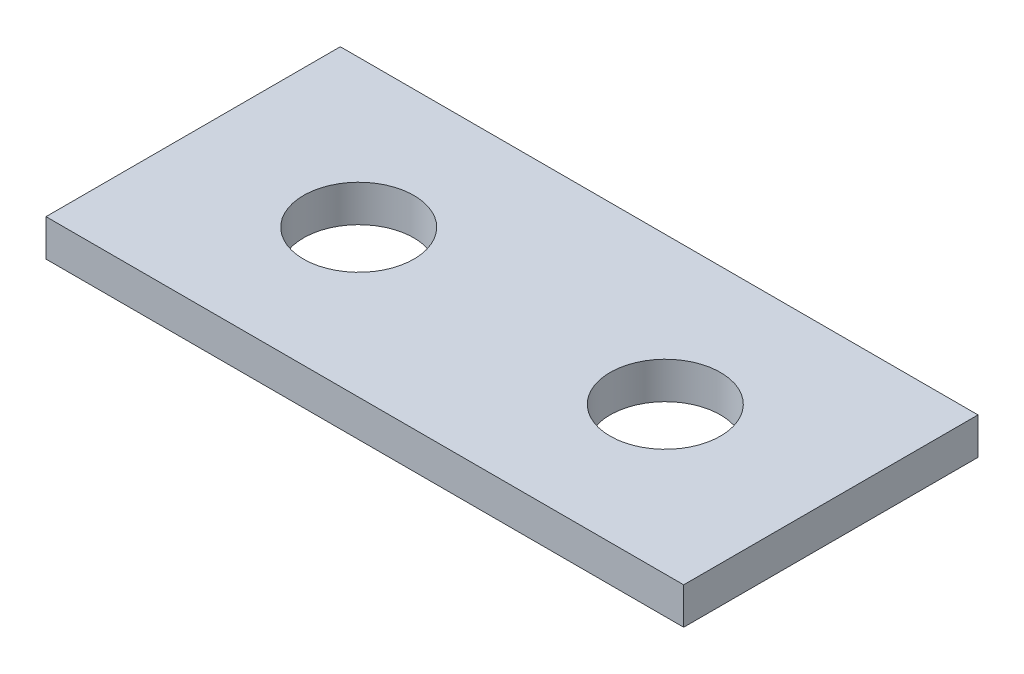
ISO-10303-21;
HEADER;
FILE_DESCRIPTION(('STEP AP214'),'2;1');
FILE_NAME('part.step','',(''),(''),'','','');
FILE_SCHEMA(('AUTOMOTIVE_DESIGN { 1 0 10303 214 1 1 1 1 }'));
ENDSEC;
DATA;
#1=APPLICATION_CONTEXT('core data for automotive mechanical design processes');
#2=APPLICATION_PROTOCOL_DEFINITION('international standard','automotive_design',2000,#1);
#3=PRODUCT_CONTEXT('',#1,'mechanical');
#4=PRODUCT('Part','Part','',(#3));
#5=PRODUCT_RELATED_PRODUCT_CATEGORY('part','',(#4));
#6=PRODUCT_DEFINITION_FORMATION('','',#4);
#7=PRODUCT_DEFINITION_CONTEXT('part definition',#1,'design');
#8=PRODUCT_DEFINITION('design','',#6,#7);
#9=PRODUCT_DEFINITION_SHAPE('','',#8);
#10=(LENGTH_UNIT() NAMED_UNIT(*) SI_UNIT(.MILLI.,.METRE.));
#11=(NAMED_UNIT(*) PLANE_ANGLE_UNIT() SI_UNIT($,.RADIAN.));
#12=(NAMED_UNIT(*) SI_UNIT($,.STERADIAN.) SOLID_ANGLE_UNIT());
#13=UNCERTAINTY_MEASURE_WITH_UNIT(LENGTH_MEASURE(1.E-05),#10,'distance_accuracy_value','');
#14=(GEOMETRIC_REPRESENTATION_CONTEXT(3) GLOBAL_UNCERTAINTY_ASSIGNED_CONTEXT((#13)) GLOBAL_UNIT_ASSIGNED_CONTEXT((#10,
#11,#12)) REPRESENTATION_CONTEXT('',''));
#15=CARTESIAN_POINT('',(0.,0.,0.));
#16=DIRECTION('',(0.,0.,1.));
#17=DIRECTION('',(1.,0.,0.));
#18=AXIS2_PLACEMENT_3D('',#15,#16,#17);
#19=CARTESIAN_POINT('',(13.,1.5,5.99999999999999));
#20=DIRECTION('',(0.,1.,0.));
#21=DIRECTION('',(0.,0.,1.));
#22=AXIS2_PLACEMENT_3D('',#19,#20,#21);
#23=PLANE('',#22);
#24=DIRECTION('',(0.,0.,-1.));
#25=VECTOR('',#24,1.);
#26=CARTESIAN_POINT('',(13.,1.5,-6.00000000000001));
#27=LINE('',#26,#25);
#28=CARTESIAN_POINT('',(13.,1.5,5.99999999999999));
#29=VERTEX_POINT('',#28);
#30=CARTESIAN_POINT('',(13.,1.5,-6.00000000000001));
#31=VERTEX_POINT('',#30);
#32=EDGE_CURVE('E84',#29,#31,#27,.T.);
#33=ORIENTED_EDGE('',*,*,#32,.T.);
#34=DIRECTION('',(-1.,0.,0.));
#35=VECTOR('',#34,1.);
#36=CARTESIAN_POINT('',(-13.,1.5,-6.00000000000001));
#37=LINE('',#36,#35);
#38=CARTESIAN_POINT('',(-13.,1.5,-6.00000000000001));
#39=VERTEX_POINT('',#38);
#40=EDGE_CURVE('E79',#31,#39,#37,.T.);
#41=ORIENTED_EDGE('',*,*,#40,.T.);
#42=DIRECTION('',(0.,0.,1.));
#43=VECTOR('',#42,1.);
#44=CARTESIAN_POINT('',(-13.,1.5,-6.00000000000001));
#45=LINE('',#44,#43);
#46=CARTESIAN_POINT('',(-13.,1.5,5.99999999999999));
#47=VERTEX_POINT('',#46);
#48=EDGE_CURVE('E82',#39,#47,#45,.T.);
#49=ORIENTED_EDGE('',*,*,#48,.T.);
#50=DIRECTION('',(1.,0.,0.));
#51=VECTOR('',#50,1.);
#52=CARTESIAN_POINT('',(-13.,1.5,5.99999999999999));
#53=LINE('',#52,#51);
#54=EDGE_CURVE('E49',#47,#29,#53,.T.);
#55=ORIENTED_EDGE('',*,*,#54,.T.);
#56=EDGE_LOOP('',(#33,#41,#49,#55));
#57=FACE_BOUND('',#56,.T.);
#58=CARTESIAN_POINT('',(-6.25,1.5,0.));
#59=DIRECTION('',(0.,1.,0.));
#60=DIRECTION('',(0.,0.,1.));
#61=AXIS2_PLACEMENT_3D('',#58,#59,#60);
#62=CIRCLE('',#61,2.25);
#63=CARTESIAN_POINT('',(-6.25,1.5,2.25));
#64=VERTEX_POINT('',#63);
#65=EDGE_CURVE('E111',#64,#64,#62,.T.);
#66=ORIENTED_EDGE('',*,*,#65,.F.);
#67=EDGE_LOOP('',(#66));
#68=FACE_BOUND('',#67,.T.);
#69=CARTESIAN_POINT('',(6.25,1.5,0.));
#70=DIRECTION('',(0.,-1.,0.));
#71=DIRECTION('',(0.,0.,1.));
#72=AXIS2_PLACEMENT_3D('',#69,#70,#71);
#73=CIRCLE('',#72,2.25);
#74=CARTESIAN_POINT('',(6.25,1.5,2.25));
#75=VERTEX_POINT('',#74);
#76=EDGE_CURVE('E117',#75,#75,#73,.T.);
#77=ORIENTED_EDGE('',*,*,#76,.T.);
#78=EDGE_LOOP('',(#77));
#79=FACE_BOUND('',#78,.T.);
#80=ADVANCED_FACE('F32',(#57,#68,#79),#23,.T.);
#81=CARTESIAN_POINT('',(13.,0.,5.99999999999999));
#82=DIRECTION('',(0.,1.,0.));
#83=DIRECTION('',(0.,0.,1.));
#84=AXIS2_PLACEMENT_3D('',#81,#82,#83);
#85=PLANE('',#84);
#86=DIRECTION('',(0.,0.,-1.));
#87=VECTOR('',#86,1.);
#88=CARTESIAN_POINT('',(13.,0.,-6.00000000000001));
#89=LINE('',#88,#87);
#90=CARTESIAN_POINT('',(13.,0.,5.99999999999999));
#91=VERTEX_POINT('',#90);
#92=CARTESIAN_POINT('',(13.,0.,-6.00000000000001));
#93=VERTEX_POINT('',#92);
#94=EDGE_CURVE('E96',#91,#93,#89,.T.);
#95=ORIENTED_EDGE('',*,*,#94,.F.);
#96=DIRECTION('',(1.,0.,0.));
#97=VECTOR('',#96,1.);
#98=CARTESIAN_POINT('',(-13.,0.,5.99999999999999));
#99=LINE('',#98,#97);
#100=CARTESIAN_POINT('',(-13.,0.,5.99999999999999));
#101=VERTEX_POINT('',#100);
#102=EDGE_CURVE('E72',#101,#91,#99,.T.);
#103=ORIENTED_EDGE('',*,*,#102,.F.);
#104=DIRECTION('',(0.,0.,1.));
#105=VECTOR('',#104,1.);
#106=CARTESIAN_POINT('',(-13.,0.,-6.00000000000001));
#107=LINE('',#106,#105);
#108=CARTESIAN_POINT('',(-13.,0.,-6.00000000000001));
#109=VERTEX_POINT('',#108);
#110=EDGE_CURVE('E66',#109,#101,#107,.T.);
#111=ORIENTED_EDGE('',*,*,#110,.F.);
#112=DIRECTION('',(-1.,0.,0.));
#113=VECTOR('',#112,1.);
#114=CARTESIAN_POINT('',(-13.,0.,-6.00000000000001));
#115=LINE('',#114,#113);
#116=EDGE_CURVE('E88',#93,#109,#115,.T.);
#117=ORIENTED_EDGE('',*,*,#116,.F.);
#118=EDGE_LOOP('',(#95,#103,#111,#117));
#119=FACE_BOUND('',#118,.T.);
#120=CARTESIAN_POINT('',(-6.25,0.,0.));
#121=DIRECTION('',(0.,1.,0.));
#122=DIRECTION('',(0.,0.,1.));
#123=AXIS2_PLACEMENT_3D('',#120,#121,#122);
#124=CIRCLE('',#123,2.25);
#125=CARTESIAN_POINT('',(-6.25,0.,2.25));
#126=VERTEX_POINT('',#125);
#127=EDGE_CURVE('E99',#126,#126,#124,.T.);
#128=ORIENTED_EDGE('',*,*,#127,.T.);
#129=EDGE_LOOP('',(#128));
#130=FACE_BOUND('',#129,.T.);
#131=CARTESIAN_POINT('',(6.25,0.,0.));
#132=DIRECTION('',(0.,-1.,0.));
#133=DIRECTION('',(0.,0.,1.));
#134=AXIS2_PLACEMENT_3D('',#131,#132,#133);
#135=CIRCLE('',#134,2.25);
#136=CARTESIAN_POINT('',(6.25,0.,2.25));
#137=VERTEX_POINT('',#136);
#138=EDGE_CURVE('E114',#137,#137,#135,.T.);
#139=ORIENTED_EDGE('',*,*,#138,.F.);
#140=EDGE_LOOP('',(#139));
#141=FACE_BOUND('',#140,.T.);
#142=ADVANCED_FACE('F107',(#119,#130,#141),#85,.F.);
#143=CARTESIAN_POINT('',(13.,1.5,-6.00000000000001));
#144=DIRECTION('',(-1.,0.,0.));
#145=DIRECTION('',(0.,0.,1.));
#146=AXIS2_PLACEMENT_3D('',#143,#144,#145);
#147=PLANE('',#146);
#148=ORIENTED_EDGE('',*,*,#94,.T.);
#149=DIRECTION('',(0.,-1.,0.));
#150=VECTOR('',#149,1.);
#151=CARTESIAN_POINT('',(13.,1.5,-6.00000000000001));
#152=LINE('',#151,#150);
#153=EDGE_CURVE('E11',#31,#93,#152,.T.);
#154=ORIENTED_EDGE('',*,*,#153,.F.);
#155=ORIENTED_EDGE('',*,*,#32,.F.);
#156=DIRECTION('',(0.,-1.,0.));
#157=VECTOR('',#156,1.);
#158=CARTESIAN_POINT('',(13.,1.5,5.99999999999999));
#159=LINE('',#158,#157);
#160=EDGE_CURVE('E92',#29,#91,#159,.T.);
#161=ORIENTED_EDGE('',*,*,#160,.T.);
#162=EDGE_LOOP('',(#148,#154,#155,#161));
#163=FACE_BOUND('',#162,.T.);
#164=ADVANCED_FACE('F34',(#163),#147,.F.);
#165=CARTESIAN_POINT('',(-13.,1.5,-6.00000000000001));
#166=DIRECTION('',(0.,0.,1.));
#167=DIRECTION('',(1.,0.,0.));
#168=AXIS2_PLACEMENT_3D('',#165,#166,#167);
#169=PLANE('',#168);
#170=ORIENTED_EDGE('',*,*,#116,.T.);
#171=DIRECTION('',(0.,-1.,0.));
#172=VECTOR('',#171,1.);
#173=CARTESIAN_POINT('',(-13.,1.5,-6.00000000000001));
#174=LINE('',#173,#172);
#175=EDGE_CURVE('E41',#39,#109,#174,.T.);
#176=ORIENTED_EDGE('',*,*,#175,.F.);
#177=ORIENTED_EDGE('',*,*,#40,.F.);
#178=ORIENTED_EDGE('',*,*,#153,.T.);
#179=EDGE_LOOP('',(#170,#176,#177,#178));
#180=FACE_BOUND('',#179,.T.);
#181=ADVANCED_FACE('F87',(#180),#169,.F.);
#182=CARTESIAN_POINT('',(-13.,1.5,-6.00000000000001));
#183=DIRECTION('',(1.,0.,0.));
#184=DIRECTION('',(0.,0.,-1.));
#185=AXIS2_PLACEMENT_3D('',#182,#183,#184);
#186=PLANE('',#185);
#187=ORIENTED_EDGE('',*,*,#110,.T.);
#188=DIRECTION('',(0.,-1.,0.));
#189=VECTOR('',#188,1.);
#190=CARTESIAN_POINT('',(-13.,1.5,5.99999999999999));
#191=LINE('',#190,#189);
#192=EDGE_CURVE('E89',#47,#101,#191,.T.);
#193=ORIENTED_EDGE('',*,*,#192,.F.);
#194=ORIENTED_EDGE('',*,*,#48,.F.);
#195=ORIENTED_EDGE('',*,*,#175,.T.);
#196=EDGE_LOOP('',(#187,#193,#194,#195));
#197=FACE_BOUND('',#196,.T.);
#198=ADVANCED_FACE('F90',(#197),#186,.F.);
#199=CARTESIAN_POINT('',(-13.,1.5,5.99999999999999));
#200=DIRECTION('',(0.,0.,-1.));
#201=DIRECTION('',(-1.,0.,0.));
#202=AXIS2_PLACEMENT_3D('',#199,#200,#201);
#203=PLANE('',#202);
#204=ORIENTED_EDGE('',*,*,#102,.T.);
#205=ORIENTED_EDGE('',*,*,#160,.F.);
#206=ORIENTED_EDGE('',*,*,#54,.F.);
#207=ORIENTED_EDGE('',*,*,#192,.T.);
#208=EDGE_LOOP('',(#204,#205,#206,#207));
#209=FACE_BOUND('',#208,.T.);
#210=ADVANCED_FACE('F104',(#209),#203,.F.);
#211=CARTESIAN_POINT('',(-6.25,0.,0.));
#212=DIRECTION('',(0.,1.,0.));
#213=DIRECTION('',(0.,0.,1.));
#214=AXIS2_PLACEMENT_3D('',#211,#212,#213);
#215=CYLINDRICAL_SURFACE('',#214,2.25);
#216=ORIENTED_EDGE('',*,*,#127,.F.);
#217=EDGE_LOOP('',(#216));
#218=FACE_BOUND('',#217,.T.);
#219=ORIENTED_EDGE('',*,*,#65,.T.);
#220=EDGE_LOOP('',(#219));
#221=FACE_BOUND('',#220,.T.);
#222=ADVANCED_FACE('F137',(#218,#221),#215,.F.);
#223=CARTESIAN_POINT('',(6.25,0.,0.));
#224=DIRECTION('',(0.,1.,0.));
#225=DIRECTION('',(0.,0.,1.));
#226=AXIS2_PLACEMENT_3D('',#223,#224,#225);
#227=CYLINDRICAL_SURFACE('',#226,2.25);
#228=ORIENTED_EDGE('',*,*,#138,.T.);
#229=EDGE_LOOP('',(#228));
#230=FACE_BOUND('',#229,.T.);
#231=ORIENTED_EDGE('',*,*,#76,.F.);
#232=EDGE_LOOP('',(#231));
#233=FACE_BOUND('',#232,.T.);
#234=ADVANCED_FACE('F123',(#230,#233),#227,.F.);
#235=CLOSED_SHELL('',(#80,#142,#164,#181,#198,#210,#222,#234));
#236=MANIFOLD_SOLID_BREP('B2',#235);
#237=ADVANCED_BREP_SHAPE_REPRESENTATION('',(#18,#236),#14);
#238=SHAPE_DEFINITION_REPRESENTATION(#9,#237);
ENDSEC;
END-ISO-10303-21;
